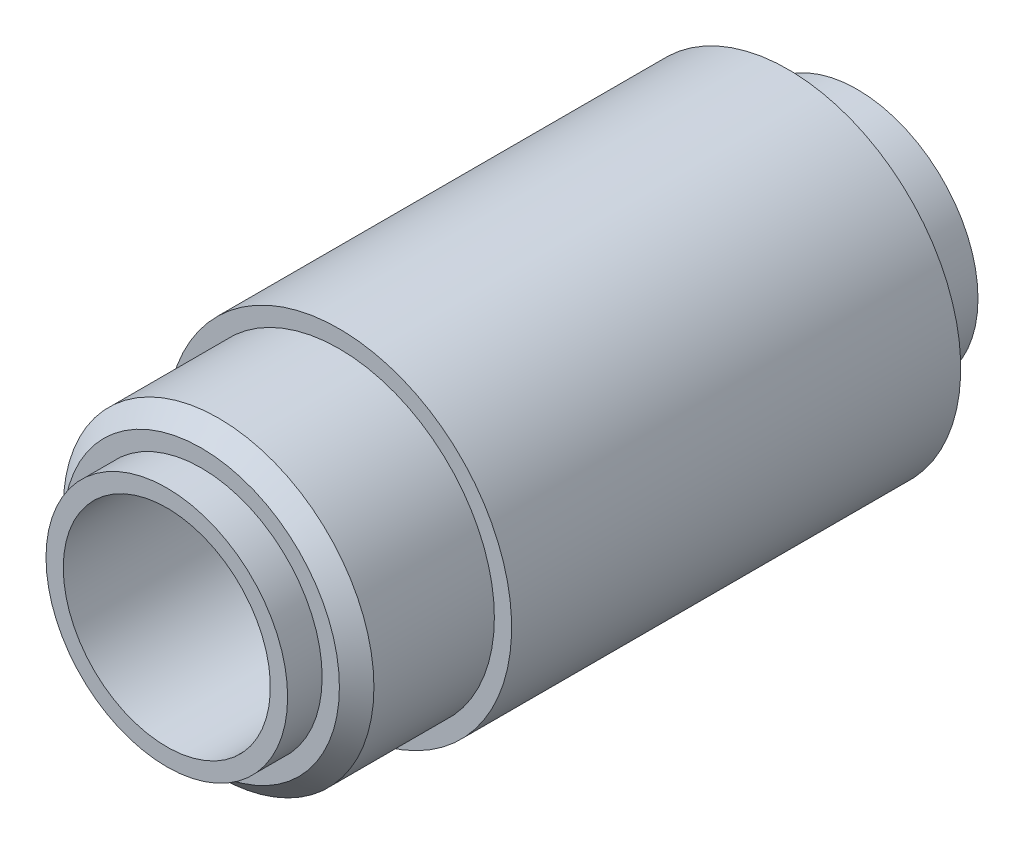
ISO-10303-21;
HEADER;
FILE_DESCRIPTION(('STEP AP214'),'2;1');
FILE_NAME('part.step','',(''),(''),'','','');
FILE_SCHEMA(('AUTOMOTIVE_DESIGN { 1 0 10303 214 1 1 1 1 }'));
ENDSEC;
DATA;
#1=APPLICATION_CONTEXT('core data for automotive mechanical design processes');
#2=APPLICATION_PROTOCOL_DEFINITION('international standard','automotive_design',2000,#1);
#3=PRODUCT_CONTEXT('',#1,'mechanical');
#4=PRODUCT('Part','Part','',(#3));
#5=PRODUCT_RELATED_PRODUCT_CATEGORY('part','',(#4));
#6=PRODUCT_DEFINITION_FORMATION('','',#4);
#7=PRODUCT_DEFINITION_CONTEXT('part definition',#1,'design');
#8=PRODUCT_DEFINITION('design','',#6,#7);
#9=PRODUCT_DEFINITION_SHAPE('','',#8);
#10=(LENGTH_UNIT() NAMED_UNIT(*) SI_UNIT(.MILLI.,.METRE.));
#11=(NAMED_UNIT(*) PLANE_ANGLE_UNIT() SI_UNIT($,.RADIAN.));
#12=(NAMED_UNIT(*) SI_UNIT($,.STERADIAN.) SOLID_ANGLE_UNIT());
#13=UNCERTAINTY_MEASURE_WITH_UNIT(LENGTH_MEASURE(1.E-05),#10,'distance_accuracy_value','');
#14=(GEOMETRIC_REPRESENTATION_CONTEXT(3) GLOBAL_UNCERTAINTY_ASSIGNED_CONTEXT((#13)) GLOBAL_UNIT_ASSIGNED_CONTEXT((#10,
#11,#12)) REPRESENTATION_CONTEXT('',''));
#15=CARTESIAN_POINT('',(0.,0.,0.));
#16=DIRECTION('',(0.,0.,1.));
#17=DIRECTION('',(1.,0.,0.));
#18=AXIS2_PLACEMENT_3D('',#15,#16,#17);
#19=CARTESIAN_POINT('',(0.,0.,0.));
#20=DIRECTION('',(0.,0.,-1.));
#21=DIRECTION('',(-1.,0.,0.));
#22=AXIS2_PLACEMENT_3D('',#19,#20,#21);
#23=CYLINDRICAL_SURFACE('',#22,3.5);
#24=CARTESIAN_POINT('',(0.,0.,20.));
#25=DIRECTION('',(0.,0.,-1.));
#26=DIRECTION('',(-1.,0.,0.));
#27=AXIS2_PLACEMENT_3D('',#24,#25,#26);
#28=CIRCLE('',#27,3.5);
#29=CARTESIAN_POINT('',(-3.5,0.,20.));
#30=VERTEX_POINT('',#29);
#31=EDGE_CURVE('E18',#30,#30,#28,.T.);
#32=ORIENTED_EDGE('',*,*,#31,.T.);
#33=EDGE_LOOP('',(#32));
#34=FACE_BOUND('',#33,.T.);
#35=CARTESIAN_POINT('',(0.,0.,19.));
#36=DIRECTION('',(0.,0.,-1.));
#37=DIRECTION('',(-1.,0.,0.));
#38=AXIS2_PLACEMENT_3D('',#35,#36,#37);
#39=CIRCLE('',#38,3.5);
#40=CARTESIAN_POINT('',(-3.5,0.,19.));
#41=VERTEX_POINT('',#40);
#42=EDGE_CURVE('E48',#41,#41,#39,.T.);
#43=ORIENTED_EDGE('',*,*,#42,.F.);
#44=EDGE_LOOP('',(#43));
#45=FACE_BOUND('',#44,.T.);
#46=ADVANCED_FACE('F15',(#34,#45),#23,.T.);
#47=CARTESIAN_POINT('',(3.,0.,20.));
#48=DIRECTION('',(0.,0.,-1.));
#49=DIRECTION('',(-1.,0.,0.));
#50=AXIS2_PLACEMENT_3D('',#47,#48,#49);
#51=PLANE('',#50);
#52=CARTESIAN_POINT('',(0.,0.,20.));
#53=DIRECTION('',(0.,0.,-1.));
#54=DIRECTION('',(-1.,0.,0.));
#55=AXIS2_PLACEMENT_3D('',#52,#53,#54);
#56=CIRCLE('',#55,3.);
#57=CARTESIAN_POINT('',(-3.,0.,20.));
#58=VERTEX_POINT('',#57);
#59=EDGE_CURVE('E46',#58,#58,#56,.T.);
#60=ORIENTED_EDGE('',*,*,#59,.T.);
#61=EDGE_LOOP('',(#60));
#62=FACE_BOUND('',#61,.T.);
#63=ORIENTED_EDGE('',*,*,#31,.F.);
#64=EDGE_LOOP('',(#63));
#65=FACE_BOUND('',#64,.T.);
#66=ADVANCED_FACE('F57',(#62,#65),#51,.F.);
#67=CARTESIAN_POINT('',(0.,0.,19.));
#68=DIRECTION('',(0.,0.,1.));
#69=DIRECTION('',(1.,0.,0.));
#70=AXIS2_PLACEMENT_3D('',#67,#68,#69);
#71=PLANE('',#70);
#72=ORIENTED_EDGE('',*,*,#42,.T.);
#73=EDGE_LOOP('',(#72));
#74=FACE_BOUND('',#73,.T.);
#75=CARTESIAN_POINT('',(0.,0.,19.0000000000623));
#76=DIRECTION('',(0.,0.,-1.));
#77=DIRECTION('',(-1.,0.,0.));
#78=AXIS2_PLACEMENT_3D('',#75,#76,#77);
#79=CIRCLE('',#78,3.99999999996226);
#80=CARTESIAN_POINT('',(-3.99999999996226,0.,19.0000000000623));
#81=VERTEX_POINT('',#80);
#82=EDGE_CURVE('E43',#81,#81,#79,.T.);
#83=ORIENTED_EDGE('',*,*,#82,.F.);
#84=EDGE_LOOP('',(#83));
#85=FACE_BOUND('',#84,.T.);
#86=ADVANCED_FACE('F59',(#74,#85),#71,.T.);
#87=CARTESIAN_POINT('',(0.,0.,19.));
#88=DIRECTION('',(0.,0.,-1.));
#89=DIRECTION('',(-1.,0.,0.));
#90=AXIS2_PLACEMENT_3D('',#87,#88,#89);
#91=CYLINDRICAL_SURFACE('',#90,3.);
#92=CARTESIAN_POINT('',(0.,0.,0.));
#93=DIRECTION('',(0.,0.,-1.));
#94=DIRECTION('',(-1.,0.,0.));
#95=AXIS2_PLACEMENT_3D('',#92,#93,#94);
#96=CIRCLE('',#95,3.);
#97=CARTESIAN_POINT('',(-3.,0.,0.));
#98=VERTEX_POINT('',#97);
#99=EDGE_CURVE('E40',#98,#98,#96,.T.);
#100=ORIENTED_EDGE('',*,*,#99,.T.);
#101=EDGE_LOOP('',(#100));
#102=FACE_BOUND('',#101,.T.);
#103=ORIENTED_EDGE('',*,*,#59,.F.);
#104=EDGE_LOOP('',(#103));
#105=FACE_BOUND('',#104,.T.);
#106=ADVANCED_FACE('F66',(#102,#105),#91,.F.);
#107=CARTESIAN_POINT('',(0.,0.,18.500000000131));
#108=DIRECTION('',(0.,0.,-1.));
#109=DIRECTION('',(-1.,0.,0.));
#110=AXIS2_PLACEMENT_3D('',#107,#108,#109);
#111=CONICAL_SURFACE('',#110,4.49999999989359,0.785398163397448);
#112=ORIENTED_EDGE('',*,*,#82,.T.);
#113=EDGE_LOOP('',(#112));
#114=FACE_BOUND('',#113,.T.);
#115=CARTESIAN_POINT('',(0.,0.,18.5000000000006));
#116=DIRECTION('',(0.,0.,1.));
#117=DIRECTION('',(1.,0.,0.));
#118=AXIS2_PLACEMENT_3D('',#115,#116,#117);
#119=CIRCLE('',#118,4.5);
#120=CARTESIAN_POINT('',(4.5,0.,18.5000000000006));
#121=VERTEX_POINT('',#120);
#122=EDGE_CURVE('E30',#121,#121,#119,.F.);
#123=ORIENTED_EDGE('',*,*,#122,.F.);
#124=EDGE_LOOP('',(#123));
#125=FACE_BOUND('',#124,.T.);
#126=ADVANCED_FACE('F94',(#114,#125),#111,.T.);
#127=CARTESIAN_POINT('',(0.,0.,0.));
#128=DIRECTION('',(0.,0.,1.));
#129=DIRECTION('',(1.,0.,0.));
#130=AXIS2_PLACEMENT_3D('',#127,#128,#129);
#131=PLANE('',#130);
#132=CARTESIAN_POINT('',(0.,0.,0.));
#133=DIRECTION('',(0.,0.,1.));
#134=DIRECTION('',(1.,0.,0.));
#135=AXIS2_PLACEMENT_3D('',#132,#133,#134);
#136=CIRCLE('',#135,3.5);
#137=CARTESIAN_POINT('',(3.5,0.,0.));
#138=VERTEX_POINT('',#137);
#139=EDGE_CURVE('E37',#138,#138,#136,.T.);
#140=ORIENTED_EDGE('',*,*,#139,.F.);
#141=EDGE_LOOP('',(#140));
#142=FACE_BOUND('',#141,.T.);
#143=ORIENTED_EDGE('',*,*,#99,.F.);
#144=EDGE_LOOP('',(#143));
#145=FACE_BOUND('',#144,.T.);
#146=ADVANCED_FACE('F90',(#142,#145),#131,.F.);
#147=CARTESIAN_POINT('',(0.,0.,19.));
#148=DIRECTION('',(0.,0.,1.));
#149=DIRECTION('',(1.,0.,0.));
#150=AXIS2_PLACEMENT_3D('',#147,#148,#149);
#151=CYLINDRICAL_SURFACE('',#150,4.5);
#152=CARTESIAN_POINT('',(0.,0.,15.0105902507811));
#153=DIRECTION('',(0.,0.,1.));
#154=DIRECTION('',(1.,0.,0.));
#155=AXIS2_PLACEMENT_3D('',#152,#153,#154);
#156=CIRCLE('',#155,4.5);
#157=CARTESIAN_POINT('',(4.5,0.,15.0105902507811));
#158=VERTEX_POINT('',#157);
#159=EDGE_CURVE('E34',#158,#158,#156,.F.);
#160=ORIENTED_EDGE('',*,*,#159,.F.);
#161=EDGE_LOOP('',(#160));
#162=FACE_BOUND('',#161,.T.);
#163=ORIENTED_EDGE('',*,*,#122,.T.);
#164=EDGE_LOOP('',(#163));
#165=FACE_BOUND('',#164,.T.);
#166=ADVANCED_FACE('F86',(#162,#165),#151,.T.);
#167=CARTESIAN_POINT('',(0.,0.,19.));
#168=DIRECTION('',(0.,0.,1.));
#169=DIRECTION('',(1.,0.,0.));
#170=AXIS2_PLACEMENT_3D('',#167,#168,#169);
#171=CYLINDRICAL_SURFACE('',#170,3.5);
#172=ORIENTED_EDGE('',*,*,#139,.T.);
#173=EDGE_LOOP('',(#172));
#174=FACE_BOUND('',#173,.T.);
#175=CARTESIAN_POINT('',(0.,0.,2.));
#176=DIRECTION('',(0.,0.,1.));
#177=DIRECTION('',(1.,0.,0.));
#178=AXIS2_PLACEMENT_3D('',#175,#176,#177);
#179=CIRCLE('',#178,3.5);
#180=CARTESIAN_POINT('',(3.5,0.,2.));
#181=VERTEX_POINT('',#180);
#182=EDGE_CURVE('E27',#181,#181,#179,.T.);
#183=ORIENTED_EDGE('',*,*,#182,.F.);
#184=EDGE_LOOP('',(#183));
#185=FACE_BOUND('',#184,.T.);
#186=ADVANCED_FACE('F82',(#174,#185),#171,.T.);
#187=CARTESIAN_POINT('',(-4.5,0.,15.0105902507811));
#188=DIRECTION('',(0.,0.,1.));
#189=DIRECTION('',(1.,0.,0.));
#190=AXIS2_PLACEMENT_3D('',#187,#188,#189);
#191=PLANE('',#190);
#192=ORIENTED_EDGE('',*,*,#159,.T.);
#193=EDGE_LOOP('',(#192));
#194=FACE_BOUND('',#193,.T.);
#195=CARTESIAN_POINT('',(0.,0.,15.0105902507811));
#196=DIRECTION('',(0.,0.,-1.));
#197=DIRECTION('',(-1.,0.,0.));
#198=AXIS2_PLACEMENT_3D('',#195,#196,#197);
#199=CIRCLE('',#198,5.);
#200=CARTESIAN_POINT('',(-5.,0.,15.0105902507811));
#201=VERTEX_POINT('',#200);
#202=EDGE_CURVE('E22',#201,#201,#199,.T.);
#203=ORIENTED_EDGE('',*,*,#202,.F.);
#204=EDGE_LOOP('',(#203));
#205=FACE_BOUND('',#204,.T.);
#206=ADVANCED_FACE('F75',(#194,#205),#191,.T.);
#207=CARTESIAN_POINT('',(-3.5,0.,2.));
#208=DIRECTION('',(0.,0.,-1.));
#209=DIRECTION('',(-1.,0.,0.));
#210=AXIS2_PLACEMENT_3D('',#207,#208,#209);
#211=PLANE('',#210);
#212=CARTESIAN_POINT('',(0.,0.,2.));
#213=DIRECTION('',(0.,0.,-1.));
#214=DIRECTION('',(-1.,0.,0.));
#215=AXIS2_PLACEMENT_3D('',#212,#213,#214);
#216=CIRCLE('',#215,5.);
#217=CARTESIAN_POINT('',(-5.,0.,2.));
#218=VERTEX_POINT('',#217);
#219=EDGE_CURVE('E10',#218,#218,#216,.F.);
#220=ORIENTED_EDGE('',*,*,#219,.F.);
#221=EDGE_LOOP('',(#220));
#222=FACE_BOUND('',#221,.T.);
#223=ORIENTED_EDGE('',*,*,#182,.T.);
#224=EDGE_LOOP('',(#223));
#225=FACE_BOUND('',#224,.T.);
#226=ADVANCED_FACE('F70',(#222,#225),#211,.T.);
#227=CARTESIAN_POINT('',(0.,0.,19.));
#228=DIRECTION('',(0.,0.,-1.));
#229=DIRECTION('',(-1.,0.,0.));
#230=AXIS2_PLACEMENT_3D('',#227,#228,#229);
#231=CYLINDRICAL_SURFACE('',#230,5.);
#232=ORIENTED_EDGE('',*,*,#219,.T.);
#233=EDGE_LOOP('',(#232));
#234=FACE_BOUND('',#233,.T.);
#235=ORIENTED_EDGE('',*,*,#202,.T.);
#236=EDGE_LOOP('',(#235));
#237=FACE_BOUND('',#236,.T.);
#238=ADVANCED_FACE('F68',(#234,#237),#231,.T.);
#239=CLOSED_SHELL('',(#46,#66,#86,#106,#126,#146,#166,#186,#206,#226,#238));
#240=MANIFOLD_SOLID_BREP('B1',#239);
#241=ADVANCED_BREP_SHAPE_REPRESENTATION('',(#18,#240),#14);
#242=SHAPE_DEFINITION_REPRESENTATION(#9,#241);
ENDSEC;
END-ISO-10303-21;
